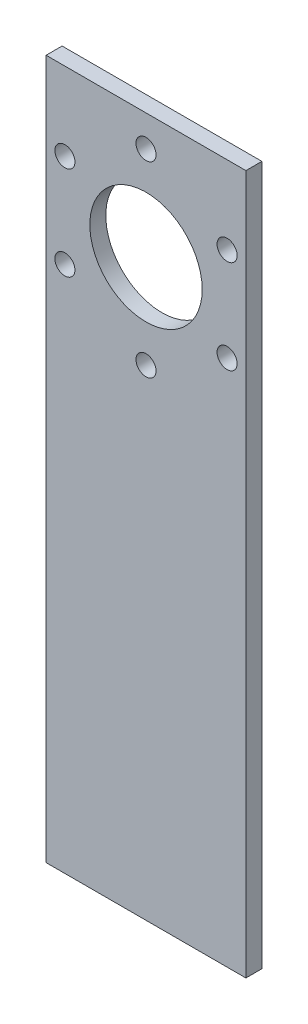
ISO-10303-21;
HEADER;
FILE_DESCRIPTION(('STEP AP214'),'2;1');
FILE_NAME('part.step','',(''),(''),'','','');
FILE_SCHEMA(('AUTOMOTIVE_DESIGN { 1 0 10303 214 1 1 1 1 }'));
ENDSEC;
DATA;
#1=APPLICATION_CONTEXT('core data for automotive mechanical design processes');
#2=APPLICATION_PROTOCOL_DEFINITION('international standard','automotive_design',2000,#1);
#3=PRODUCT_CONTEXT('',#1,'mechanical');
#4=PRODUCT('Part','Part','',(#3));
#5=PRODUCT_RELATED_PRODUCT_CATEGORY('part','',(#4));
#6=PRODUCT_DEFINITION_FORMATION('','',#4);
#7=PRODUCT_DEFINITION_CONTEXT('part definition',#1,'design');
#8=PRODUCT_DEFINITION('design','',#6,#7);
#9=PRODUCT_DEFINITION_SHAPE('','',#8);
#10=(LENGTH_UNIT() NAMED_UNIT(*) SI_UNIT(.MILLI.,.METRE.));
#11=(NAMED_UNIT(*) PLANE_ANGLE_UNIT() SI_UNIT($,.RADIAN.));
#12=(NAMED_UNIT(*) SI_UNIT($,.STERADIAN.) SOLID_ANGLE_UNIT());
#13=UNCERTAINTY_MEASURE_WITH_UNIT(LENGTH_MEASURE(1.E-05),#10,'distance_accuracy_value','');
#14=(GEOMETRIC_REPRESENTATION_CONTEXT(3) GLOBAL_UNCERTAINTY_ASSIGNED_CONTEXT((#13)) GLOBAL_UNIT_ASSIGNED_CONTEXT((#10,
#11,#12)) REPRESENTATION_CONTEXT('',''));
#15=CARTESIAN_POINT('',(0.,0.,0.));
#16=DIRECTION('',(0.,0.,1.));
#17=DIRECTION('',(1.,0.,0.));
#18=AXIS2_PLACEMENT_3D('',#15,#16,#17);
#19=CARTESIAN_POINT('',(0.,0.,4.064));
#20=DIRECTION('',(0.,0.,-1.));
#21=DIRECTION('',(-1.,0.,0.));
#22=AXIS2_PLACEMENT_3D('',#19,#20,#21);
#23=PLANE('',#22);
#24=CARTESIAN_POINT('',(46.022229927617,157.95625,4.064));
#25=DIRECTION('',(0.,0.,1.));
#26=DIRECTION('',(1.,0.,0.));
#27=AXIS2_PLACEMENT_3D('',#24,#25,#26);
#28=CIRCLE('',#27,2.55269999999999);
#29=CARTESIAN_POINT('',(48.5749299276169,157.95625,4.064));
#30=VERTEX_POINT('',#29);
#31=EDGE_CURVE('E150',#30,#30,#28,.T.);
#32=ORIENTED_EDGE('',*,*,#31,.F.);
#33=EDGE_LOOP('',(#32));
#34=FACE_BOUND('',#33,.T.);
#35=CARTESIAN_POINT('',(25.4,169.8625,4.064));
#36=DIRECTION('',(0.,0.,1.));
#37=DIRECTION('',(1.,0.,0.));
#38=AXIS2_PLACEMENT_3D('',#35,#36,#37);
#39=CIRCLE('',#38,2.55269999999999);
#40=CARTESIAN_POINT('',(27.9527,169.8625,4.064));
#41=VERTEX_POINT('',#40);
#42=EDGE_CURVE('E144',#41,#41,#39,.T.);
#43=ORIENTED_EDGE('',*,*,#42,.F.);
#44=EDGE_LOOP('',(#43));
#45=FACE_BOUND('',#44,.T.);
#46=CARTESIAN_POINT('',(4.77777007238311,157.95625,4.064));
#47=DIRECTION('',(0.,0.,1.));
#48=DIRECTION('',(1.,0.,0.));
#49=AXIS2_PLACEMENT_3D('',#46,#47,#48);
#50=CIRCLE('',#49,2.55269999999999);
#51=CARTESIAN_POINT('',(7.3304700723831,157.95625,4.064));
#52=VERTEX_POINT('',#51);
#53=EDGE_CURVE('E138',#52,#52,#50,.T.);
#54=ORIENTED_EDGE('',*,*,#53,.F.);
#55=EDGE_LOOP('',(#54));
#56=FACE_BOUND('',#55,.T.);
#57=CARTESIAN_POINT('',(4.77777007238311,134.14375,4.064));
#58=DIRECTION('',(0.,0.,1.));
#59=DIRECTION('',(1.,0.,0.));
#60=AXIS2_PLACEMENT_3D('',#57,#58,#59);
#61=CIRCLE('',#60,2.55269999999999);
#62=CARTESIAN_POINT('',(7.3304700723831,134.14375,4.064));
#63=VERTEX_POINT('',#62);
#64=EDGE_CURVE('E132',#63,#63,#61,.T.);
#65=ORIENTED_EDGE('',*,*,#64,.F.);
#66=EDGE_LOOP('',(#65));
#67=FACE_BOUND('',#66,.T.);
#68=CARTESIAN_POINT('',(25.4,122.2375,4.064));
#69=DIRECTION('',(0.,0.,1.));
#70=DIRECTION('',(1.,0.,0.));
#71=AXIS2_PLACEMENT_3D('',#68,#69,#70);
#72=CIRCLE('',#71,2.55269999999999);
#73=CARTESIAN_POINT('',(27.9527,122.2375,4.064));
#74=VERTEX_POINT('',#73);
#75=EDGE_CURVE('E126',#74,#74,#72,.T.);
#76=ORIENTED_EDGE('',*,*,#75,.F.);
#77=EDGE_LOOP('',(#76));
#78=FACE_BOUND('',#77,.T.);
#79=CARTESIAN_POINT('',(46.022229927617,134.14375,4.064));
#80=DIRECTION('',(0.,0.,1.));
#81=DIRECTION('',(1.,0.,0.));
#82=AXIS2_PLACEMENT_3D('',#79,#80,#81);
#83=CIRCLE('',#82,2.55269999999999);
#84=CARTESIAN_POINT('',(48.5749299276169,134.14375,4.064));
#85=VERTEX_POINT('',#84);
#86=EDGE_CURVE('E120',#85,#85,#83,.T.);
#87=ORIENTED_EDGE('',*,*,#86,.F.);
#88=EDGE_LOOP('',(#87));
#89=FACE_BOUND('',#88,.T.);
#90=DIRECTION('',(0.,-1.,0.));
#91=VECTOR('',#90,1.);
#92=CARTESIAN_POINT('',(0.,0.,4.064));
#93=LINE('',#92,#91);
#94=CARTESIAN_POINT('',(0.,177.8,4.064));
#95=VERTEX_POINT('',#94);
#96=CARTESIAN_POINT('',(0.,0.,4.064));
#97=VERTEX_POINT('',#96);
#98=EDGE_CURVE('E85',#95,#97,#93,.T.);
#99=ORIENTED_EDGE('',*,*,#98,.T.);
#100=DIRECTION('',(1.,0.,0.));
#101=VECTOR('',#100,1.);
#102=CARTESIAN_POINT('',(0.,0.,4.064));
#103=LINE('',#102,#101);
#104=CARTESIAN_POINT('',(50.8,0.,4.064));
#105=VERTEX_POINT('',#104);
#106=EDGE_CURVE('E80',#97,#105,#103,.T.);
#107=ORIENTED_EDGE('',*,*,#106,.T.);
#108=DIRECTION('',(0.,1.,0.));
#109=VECTOR('',#108,1.);
#110=CARTESIAN_POINT('',(50.8,0.,4.064));
#111=LINE('',#110,#109);
#112=CARTESIAN_POINT('',(50.8,177.8,4.064));
#113=VERTEX_POINT('',#112);
#114=EDGE_CURVE('E83',#105,#113,#111,.T.);
#115=ORIENTED_EDGE('',*,*,#114,.T.);
#116=DIRECTION('',(-1.,0.,0.));
#117=VECTOR('',#116,1.);
#118=CARTESIAN_POINT('',(0.,177.8,4.064));
#119=LINE('',#118,#117);
#120=EDGE_CURVE('E50',#113,#95,#119,.T.);
#121=ORIENTED_EDGE('',*,*,#120,.T.);
#122=EDGE_LOOP('',(#99,#107,#115,#121));
#123=FACE_BOUND('',#122,.T.);
#124=CARTESIAN_POINT('',(25.4,146.05,4.064));
#125=DIRECTION('',(0.,0.,1.));
#126=DIRECTION('',(1.,0.,0.));
#127=AXIS2_PLACEMENT_3D('',#124,#125,#126);
#128=CIRCLE('',#127,14.2875);
#129=CARTESIAN_POINT('',(39.6875,146.05,4.064));
#130=VERTEX_POINT('',#129);
#131=EDGE_CURVE('E100',#130,#130,#128,.T.);
#132=ORIENTED_EDGE('',*,*,#131,.F.);
#133=EDGE_LOOP('',(#132));
#134=FACE_BOUND('',#133,.T.);
#135=ADVANCED_FACE('F33',(#34,#45,#56,#67,#78,#89,#123,#134),#23,.F.);
#136=CARTESIAN_POINT('',(0.,0.,0.));
#137=DIRECTION('',(0.,0.,-1.));
#138=DIRECTION('',(-1.,0.,0.));
#139=AXIS2_PLACEMENT_3D('',#136,#137,#138);
#140=PLANE('',#139);
#141=CARTESIAN_POINT('',(46.022229927617,157.95625,0.));
#142=DIRECTION('',(0.,0.,1.));
#143=DIRECTION('',(1.,0.,0.));
#144=AXIS2_PLACEMENT_3D('',#141,#142,#143);
#145=CIRCLE('',#144,2.55269999999999);
#146=CARTESIAN_POINT('',(48.5749299276169,157.95625,0.));
#147=VERTEX_POINT('',#146);
#148=EDGE_CURVE('E147',#147,#147,#145,.T.);
#149=ORIENTED_EDGE('',*,*,#148,.T.);
#150=EDGE_LOOP('',(#149));
#151=FACE_BOUND('',#150,.T.);
#152=CARTESIAN_POINT('',(25.4,169.8625,0.));
#153=DIRECTION('',(0.,0.,1.));
#154=DIRECTION('',(1.,0.,0.));
#155=AXIS2_PLACEMENT_3D('',#152,#153,#154);
#156=CIRCLE('',#155,2.55269999999999);
#157=CARTESIAN_POINT('',(27.9527,169.8625,0.));
#158=VERTEX_POINT('',#157);
#159=EDGE_CURVE('E141',#158,#158,#156,.T.);
#160=ORIENTED_EDGE('',*,*,#159,.T.);
#161=EDGE_LOOP('',(#160));
#162=FACE_BOUND('',#161,.T.);
#163=CARTESIAN_POINT('',(4.77777007238311,157.95625,0.));
#164=DIRECTION('',(0.,0.,1.));
#165=DIRECTION('',(1.,0.,0.));
#166=AXIS2_PLACEMENT_3D('',#163,#164,#165);
#167=CIRCLE('',#166,2.55269999999999);
#168=CARTESIAN_POINT('',(7.3304700723831,157.95625,0.));
#169=VERTEX_POINT('',#168);
#170=EDGE_CURVE('E135',#169,#169,#167,.T.);
#171=ORIENTED_EDGE('',*,*,#170,.T.);
#172=EDGE_LOOP('',(#171));
#173=FACE_BOUND('',#172,.T.);
#174=CARTESIAN_POINT('',(4.77777007238311,134.14375,0.));
#175=DIRECTION('',(0.,0.,1.));
#176=DIRECTION('',(1.,0.,0.));
#177=AXIS2_PLACEMENT_3D('',#174,#175,#176);
#178=CIRCLE('',#177,2.55269999999999);
#179=CARTESIAN_POINT('',(7.3304700723831,134.14375,0.));
#180=VERTEX_POINT('',#179);
#181=EDGE_CURVE('E129',#180,#180,#178,.T.);
#182=ORIENTED_EDGE('',*,*,#181,.T.);
#183=EDGE_LOOP('',(#182));
#184=FACE_BOUND('',#183,.T.);
#185=CARTESIAN_POINT('',(25.4,122.2375,0.));
#186=DIRECTION('',(0.,0.,1.));
#187=DIRECTION('',(1.,0.,0.));
#188=AXIS2_PLACEMENT_3D('',#185,#186,#187);
#189=CIRCLE('',#188,2.55269999999999);
#190=CARTESIAN_POINT('',(27.9527,122.2375,0.));
#191=VERTEX_POINT('',#190);
#192=EDGE_CURVE('E123',#191,#191,#189,.T.);
#193=ORIENTED_EDGE('',*,*,#192,.T.);
#194=EDGE_LOOP('',(#193));
#195=FACE_BOUND('',#194,.T.);
#196=CARTESIAN_POINT('',(46.022229927617,134.14375,0.));
#197=DIRECTION('',(0.,0.,1.));
#198=DIRECTION('',(1.,0.,0.));
#199=AXIS2_PLACEMENT_3D('',#196,#197,#198);
#200=CIRCLE('',#199,2.55269999999999);
#201=CARTESIAN_POINT('',(48.5749299276169,134.14375,0.));
#202=VERTEX_POINT('',#201);
#203=EDGE_CURVE('E115',#202,#202,#200,.T.);
#204=ORIENTED_EDGE('',*,*,#203,.T.);
#205=EDGE_LOOP('',(#204));
#206=FACE_BOUND('',#205,.T.);
#207=DIRECTION('',(0.,-1.,0.));
#208=VECTOR('',#207,1.);
#209=CARTESIAN_POINT('',(0.,0.,0.));
#210=LINE('',#209,#208);
#211=CARTESIAN_POINT('',(0.,177.8,0.));
#212=VERTEX_POINT('',#211);
#213=CARTESIAN_POINT('',(0.,0.,0.));
#214=VERTEX_POINT('',#213);
#215=EDGE_CURVE('E97',#212,#214,#210,.T.);
#216=ORIENTED_EDGE('',*,*,#215,.F.);
#217=DIRECTION('',(-1.,0.,0.));
#218=VECTOR('',#217,1.);
#219=CARTESIAN_POINT('',(0.,177.8,0.));
#220=LINE('',#219,#218);
#221=CARTESIAN_POINT('',(50.8,177.8,0.));
#222=VERTEX_POINT('',#221);
#223=EDGE_CURVE('E73',#222,#212,#220,.T.);
#224=ORIENTED_EDGE('',*,*,#223,.F.);
#225=DIRECTION('',(0.,1.,0.));
#226=VECTOR('',#225,1.);
#227=CARTESIAN_POINT('',(50.8,0.,0.));
#228=LINE('',#227,#226);
#229=CARTESIAN_POINT('',(50.8,0.,0.));
#230=VERTEX_POINT('',#229);
#231=EDGE_CURVE('E67',#230,#222,#228,.T.);
#232=ORIENTED_EDGE('',*,*,#231,.F.);
#233=DIRECTION('',(1.,0.,0.));
#234=VECTOR('',#233,1.);
#235=CARTESIAN_POINT('',(0.,0.,0.));
#236=LINE('',#235,#234);
#237=EDGE_CURVE('E89',#214,#230,#236,.T.);
#238=ORIENTED_EDGE('',*,*,#237,.F.);
#239=EDGE_LOOP('',(#216,#224,#232,#238));
#240=FACE_BOUND('',#239,.T.);
#241=CARTESIAN_POINT('',(25.4,146.05,0.));
#242=DIRECTION('',(0.,0.,1.));
#243=DIRECTION('',(1.,0.,0.));
#244=AXIS2_PLACEMENT_3D('',#241,#242,#243);
#245=CIRCLE('',#244,14.2875);
#246=CARTESIAN_POINT('',(39.6875,146.05,0.));
#247=VERTEX_POINT('',#246);
#248=EDGE_CURVE('E112',#247,#247,#245,.T.);
#249=ORIENTED_EDGE('',*,*,#248,.T.);
#250=EDGE_LOOP('',(#249));
#251=FACE_BOUND('',#250,.T.);
#252=ADVANCED_FACE('F108',(#151,#162,#173,#184,#195,#206,#240,#251),#140,.T.);
#253=CARTESIAN_POINT('',(0.,0.,4.064));
#254=DIRECTION('',(1.,0.,0.));
#255=DIRECTION('',(0.,0.,-1.));
#256=AXIS2_PLACEMENT_3D('',#253,#254,#255);
#257=PLANE('',#256);
#258=ORIENTED_EDGE('',*,*,#215,.T.);
#259=DIRECTION('',(0.,0.,-1.));
#260=VECTOR('',#259,1.);
#261=CARTESIAN_POINT('',(0.,0.,4.064));
#262=LINE('',#261,#260);
#263=EDGE_CURVE('E11',#97,#214,#262,.T.);
#264=ORIENTED_EDGE('',*,*,#263,.F.);
#265=ORIENTED_EDGE('',*,*,#98,.F.);
#266=DIRECTION('',(0.,0.,-1.));
#267=VECTOR('',#266,1.);
#268=CARTESIAN_POINT('',(0.,177.8,4.064));
#269=LINE('',#268,#267);
#270=EDGE_CURVE('E93',#95,#212,#269,.T.);
#271=ORIENTED_EDGE('',*,*,#270,.T.);
#272=EDGE_LOOP('',(#258,#264,#265,#271));
#273=FACE_BOUND('',#272,.T.);
#274=ADVANCED_FACE('F35',(#273),#257,.F.);
#275=CARTESIAN_POINT('',(0.,0.,4.064));
#276=DIRECTION('',(0.,1.,0.));
#277=DIRECTION('',(0.,0.,1.));
#278=AXIS2_PLACEMENT_3D('',#275,#276,#277);
#279=PLANE('',#278);
#280=ORIENTED_EDGE('',*,*,#237,.T.);
#281=DIRECTION('',(0.,0.,-1.));
#282=VECTOR('',#281,1.);
#283=CARTESIAN_POINT('',(50.8,0.,4.064));
#284=LINE('',#283,#282);
#285=EDGE_CURVE('E42',#105,#230,#284,.T.);
#286=ORIENTED_EDGE('',*,*,#285,.F.);
#287=ORIENTED_EDGE('',*,*,#106,.F.);
#288=ORIENTED_EDGE('',*,*,#263,.T.);
#289=EDGE_LOOP('',(#280,#286,#287,#288));
#290=FACE_BOUND('',#289,.T.);
#291=ADVANCED_FACE('F88',(#290),#279,.F.);
#292=CARTESIAN_POINT('',(50.8,0.,4.064));
#293=DIRECTION('',(-1.,0.,0.));
#294=DIRECTION('',(0.,0.,1.));
#295=AXIS2_PLACEMENT_3D('',#292,#293,#294);
#296=PLANE('',#295);
#297=ORIENTED_EDGE('',*,*,#231,.T.);
#298=DIRECTION('',(0.,0.,-1.));
#299=VECTOR('',#298,1.);
#300=CARTESIAN_POINT('',(50.8,177.8,4.064));
#301=LINE('',#300,#299);
#302=EDGE_CURVE('E90',#113,#222,#301,.T.);
#303=ORIENTED_EDGE('',*,*,#302,.F.);
#304=ORIENTED_EDGE('',*,*,#114,.F.);
#305=ORIENTED_EDGE('',*,*,#285,.T.);
#306=EDGE_LOOP('',(#297,#303,#304,#305));
#307=FACE_BOUND('',#306,.T.);
#308=ADVANCED_FACE('F91',(#307),#296,.F.);
#309=CARTESIAN_POINT('',(0.,177.8,4.064));
#310=DIRECTION('',(0.,-1.,0.));
#311=DIRECTION('',(0.,0.,-1.));
#312=AXIS2_PLACEMENT_3D('',#309,#310,#311);
#313=PLANE('',#312);
#314=ORIENTED_EDGE('',*,*,#223,.T.);
#315=ORIENTED_EDGE('',*,*,#270,.F.);
#316=ORIENTED_EDGE('',*,*,#120,.F.);
#317=ORIENTED_EDGE('',*,*,#302,.T.);
#318=EDGE_LOOP('',(#314,#315,#316,#317));
#319=FACE_BOUND('',#318,.T.);
#320=ADVANCED_FACE('F105',(#319),#313,.F.);
#321=CARTESIAN_POINT('',(25.4,146.05,4.064));
#322=DIRECTION('',(0.,0.,-1.));
#323=DIRECTION('',(-1.,0.,0.));
#324=AXIS2_PLACEMENT_3D('',#321,#322,#323);
#325=CYLINDRICAL_SURFACE('',#324,14.2875);
#326=ORIENTED_EDGE('',*,*,#131,.T.);
#327=EDGE_LOOP('',(#326));
#328=FACE_BOUND('',#327,.T.);
#329=ORIENTED_EDGE('',*,*,#248,.F.);
#330=EDGE_LOOP('',(#329));
#331=FACE_BOUND('',#330,.T.);
#332=ADVANCED_FACE('F172',(#328,#331),#325,.F.);
#333=CARTESIAN_POINT('',(46.022229927617,134.14375,4.064));
#334=DIRECTION('',(0.,0.,1.));
#335=DIRECTION('',(1.,0.,0.));
#336=AXIS2_PLACEMENT_3D('',#333,#334,#335);
#337=CYLINDRICAL_SURFACE('',#336,2.55269999999999);
#338=ORIENTED_EDGE('',*,*,#203,.F.);
#339=EDGE_LOOP('',(#338));
#340=FACE_BOUND('',#339,.T.);
#341=ORIENTED_EDGE('',*,*,#86,.T.);
#342=EDGE_LOOP('',(#341));
#343=FACE_BOUND('',#342,.T.);
#344=ADVANCED_FACE('F169',(#340,#343),#337,.F.);
#345=CARTESIAN_POINT('',(25.4,122.2375,4.064));
#346=DIRECTION('',(0.,0.,1.));
#347=DIRECTION('',(1.,0.,0.));
#348=AXIS2_PLACEMENT_3D('',#345,#346,#347);
#349=CYLINDRICAL_SURFACE('',#348,2.55269999999999);
#350=ORIENTED_EDGE('',*,*,#192,.F.);
#351=EDGE_LOOP('',(#350));
#352=FACE_BOUND('',#351,.T.);
#353=ORIENTED_EDGE('',*,*,#75,.T.);
#354=EDGE_LOOP('',(#353));
#355=FACE_BOUND('',#354,.T.);
#356=ADVANCED_FACE('F171',(#352,#355),#349,.F.);
#357=CARTESIAN_POINT('',(4.77777007238311,134.14375,4.064));
#358=DIRECTION('',(0.,0.,1.));
#359=DIRECTION('',(1.,0.,0.));
#360=AXIS2_PLACEMENT_3D('',#357,#358,#359);
#361=CYLINDRICAL_SURFACE('',#360,2.55269999999999);
#362=ORIENTED_EDGE('',*,*,#181,.F.);
#363=EDGE_LOOP('',(#362));
#364=FACE_BOUND('',#363,.T.);
#365=ORIENTED_EDGE('',*,*,#64,.T.);
#366=EDGE_LOOP('',(#365));
#367=FACE_BOUND('',#366,.T.);
#368=ADVANCED_FACE('F179',(#364,#367),#361,.F.);
#369=CARTESIAN_POINT('',(4.77777007238311,157.95625,4.064));
#370=DIRECTION('',(0.,0.,1.));
#371=DIRECTION('',(1.,0.,0.));
#372=AXIS2_PLACEMENT_3D('',#369,#370,#371);
#373=CYLINDRICAL_SURFACE('',#372,2.55269999999999);
#374=ORIENTED_EDGE('',*,*,#170,.F.);
#375=EDGE_LOOP('',(#374));
#376=FACE_BOUND('',#375,.T.);
#377=ORIENTED_EDGE('',*,*,#53,.T.);
#378=EDGE_LOOP('',(#377));
#379=FACE_BOUND('',#378,.T.);
#380=ADVANCED_FACE('F252',(#376,#379),#373,.F.);
#381=CARTESIAN_POINT('',(25.4,169.8625,4.064));
#382=DIRECTION('',(0.,0.,1.));
#383=DIRECTION('',(1.,0.,0.));
#384=AXIS2_PLACEMENT_3D('',#381,#382,#383);
#385=CYLINDRICAL_SURFACE('',#384,2.55269999999999);
#386=ORIENTED_EDGE('',*,*,#159,.F.);
#387=EDGE_LOOP('',(#386));
#388=FACE_BOUND('',#387,.T.);
#389=ORIENTED_EDGE('',*,*,#42,.T.);
#390=EDGE_LOOP('',(#389));
#391=FACE_BOUND('',#390,.T.);
#392=ADVANCED_FACE('F260',(#388,#391),#385,.F.);
#393=CARTESIAN_POINT('',(46.022229927617,157.95625,4.064));
#394=DIRECTION('',(0.,0.,1.));
#395=DIRECTION('',(1.,0.,0.));
#396=AXIS2_PLACEMENT_3D('',#393,#394,#395);
#397=CYLINDRICAL_SURFACE('',#396,2.55269999999999);
#398=ORIENTED_EDGE('',*,*,#148,.F.);
#399=EDGE_LOOP('',(#398));
#400=FACE_BOUND('',#399,.T.);
#401=ORIENTED_EDGE('',*,*,#31,.T.);
#402=EDGE_LOOP('',(#401));
#403=FACE_BOUND('',#402,.T.);
#404=ADVANCED_FACE('F154',(#400,#403),#397,.F.);
#405=CLOSED_SHELL('',(#135,#252,#274,#291,#308,#320,#332,#344,#356,#368,#380,#392,#404));
#406=MANIFOLD_SOLID_BREP('B2',#405);
#407=ADVANCED_BREP_SHAPE_REPRESENTATION('',(#18,#406),#14);
#408=SHAPE_DEFINITION_REPRESENTATION(#9,#407);
ENDSEC;
END-ISO-10303-21;
